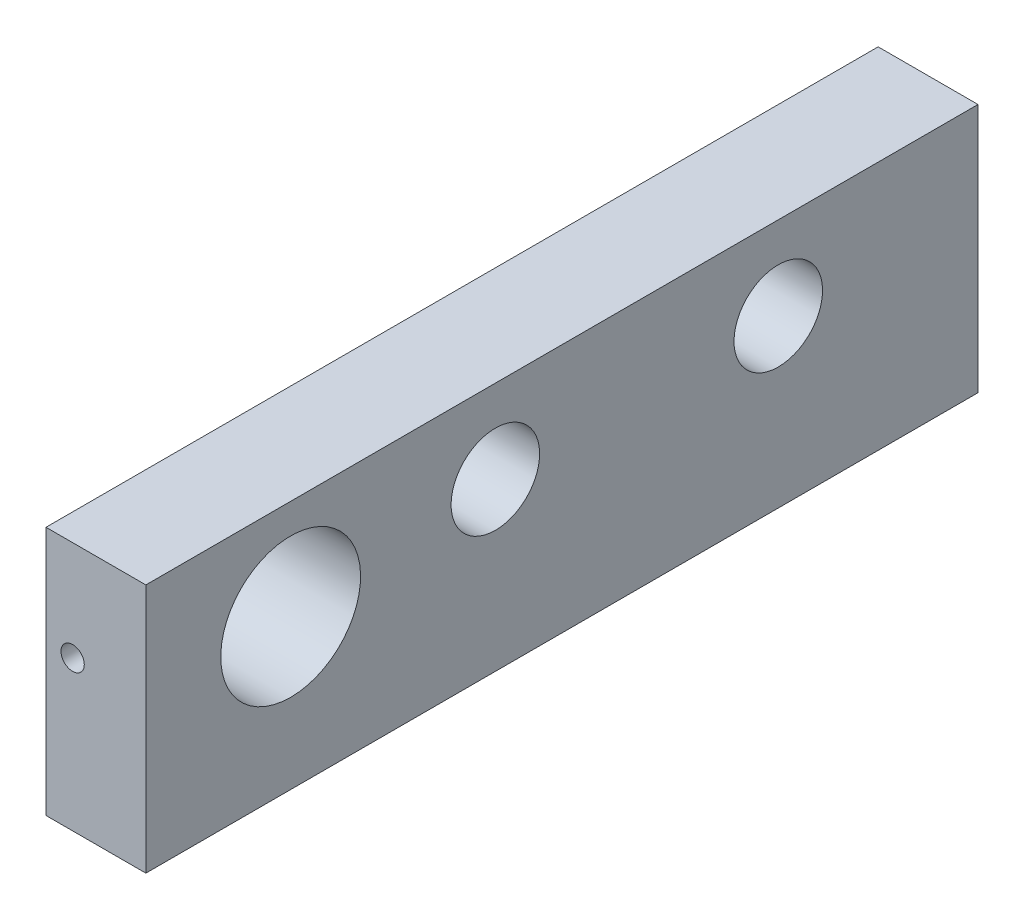
ISO-10303-21;
HEADER;
FILE_DESCRIPTION(('STEP AP214'),'2;1');
FILE_NAME('part.step','',(''),(''),'','','');
FILE_SCHEMA(('AUTOMOTIVE_DESIGN { 1 0 10303 214 1 1 1 1 }'));
ENDSEC;
DATA;
#1=APPLICATION_CONTEXT('core data for automotive mechanical design processes');
#2=APPLICATION_PROTOCOL_DEFINITION('international standard','automotive_design',2000,#1);
#3=PRODUCT_CONTEXT('',#1,'mechanical');
#4=PRODUCT('Part','Part','',(#3));
#5=PRODUCT_RELATED_PRODUCT_CATEGORY('part','',(#4));
#6=PRODUCT_DEFINITION_FORMATION('','',#4);
#7=PRODUCT_DEFINITION_CONTEXT('part definition',#1,'design');
#8=PRODUCT_DEFINITION('design','',#6,#7);
#9=PRODUCT_DEFINITION_SHAPE('','',#8);
#10=(LENGTH_UNIT() NAMED_UNIT(*) SI_UNIT(.MILLI.,.METRE.));
#11=(NAMED_UNIT(*) PLANE_ANGLE_UNIT() SI_UNIT($,.RADIAN.));
#12=(NAMED_UNIT(*) SI_UNIT($,.STERADIAN.) SOLID_ANGLE_UNIT());
#13=UNCERTAINTY_MEASURE_WITH_UNIT(LENGTH_MEASURE(1.E-05),#10,'distance_accuracy_value','');
#14=(GEOMETRIC_REPRESENTATION_CONTEXT(3) GLOBAL_UNCERTAINTY_ASSIGNED_CONTEXT((#13)) GLOBAL_UNIT_ASSIGNED_CONTEXT((#10,
#11,#12)) REPRESENTATION_CONTEXT('',''));
#15=CARTESIAN_POINT('',(0.,0.,0.));
#16=DIRECTION('',(0.,0.,1.));
#17=DIRECTION('',(1.,0.,0.));
#18=AXIS2_PLACEMENT_3D('',#15,#16,#17);
#19=CARTESIAN_POINT('',(0.,0.,-63.5));
#20=DIRECTION('',(-1.,0.,0.));
#21=DIRECTION('',(0.,-1.,0.));
#22=AXIS2_PLACEMENT_3D('',#19,#20,#21);
#23=PLANE('',#22);
#24=CARTESIAN_POINT('',(0.,11.43,-11.049));
#25=DIRECTION('',(-1.,0.,0.));
#26=DIRECTION('',(0.,-1.,0.));
#27=AXIS2_PLACEMENT_3D('',#24,#25,#26);
#28=CIRCLE('',#27,5.334);
#29=CARTESIAN_POINT('',(0.,6.096,-11.049));
#30=VERTEX_POINT('',#29);
#31=EDGE_CURVE('E167',#30,#30,#28,.T.);
#32=ORIENTED_EDGE('',*,*,#31,.F.);
#33=EDGE_LOOP('',(#32));
#34=FACE_BOUND('',#33,.T.);
#35=CARTESIAN_POINT('',(0.,12.7,-26.67));
#36=DIRECTION('',(-1.,0.,0.));
#37=DIRECTION('',(0.,-1.,0.));
#38=AXIS2_PLACEMENT_3D('',#35,#36,#37);
#39=CIRCLE('',#38,3.3782);
#40=CARTESIAN_POINT('',(0.,9.3218,-26.67));
#41=VERTEX_POINT('',#40);
#42=EDGE_CURVE('E174',#41,#41,#39,.T.);
#43=ORIENTED_EDGE('',*,*,#42,.F.);
#44=EDGE_LOOP('',(#43));
#45=FACE_BOUND('',#44,.T.);
#46=CARTESIAN_POINT('',(0.,12.7,-48.26));
#47=DIRECTION('',(-1.,0.,0.));
#48=DIRECTION('',(0.,-1.,0.));
#49=AXIS2_PLACEMENT_3D('',#46,#47,#48);
#50=CIRCLE('',#49,3.3782);
#51=CARTESIAN_POINT('',(0.,9.3218,-48.26));
#52=VERTEX_POINT('',#51);
#53=EDGE_CURVE('E182',#52,#52,#50,.T.);
#54=ORIENTED_EDGE('',*,*,#53,.F.);
#55=EDGE_LOOP('',(#54));
#56=FACE_BOUND('',#55,.T.);
#57=DIRECTION('',(0.,-1.,0.));
#58=VECTOR('',#57,1.);
#59=CARTESIAN_POINT('',(0.,0.,0.));
#60=LINE('',#59,#58);
#61=CARTESIAN_POINT('',(0.,19.05,0.));
#62=VERTEX_POINT('',#61);
#63=CARTESIAN_POINT('',(0.,0.,0.));
#64=VERTEX_POINT('',#63);
#65=EDGE_CURVE('E115',#62,#64,#60,.T.);
#66=ORIENTED_EDGE('',*,*,#65,.F.);
#67=DIRECTION('',(0.,0.,1.));
#68=VECTOR('',#67,1.);
#69=CARTESIAN_POINT('',(0.,19.05,-63.5));
#70=LINE('',#69,#68);
#71=CARTESIAN_POINT('',(0.,19.05,-63.5));
#72=VERTEX_POINT('',#71);
#73=EDGE_CURVE('E11',#72,#62,#70,.T.);
#74=ORIENTED_EDGE('',*,*,#73,.F.);
#75=DIRECTION('',(0.,-1.,0.));
#76=VECTOR('',#75,1.);
#77=CARTESIAN_POINT('',(0.,0.,-63.5));
#78=LINE('',#77,#76);
#79=CARTESIAN_POINT('',(0.,0.,-63.5));
#80=VERTEX_POINT('',#79);
#81=EDGE_CURVE('E108',#72,#80,#78,.T.);
#82=ORIENTED_EDGE('',*,*,#81,.T.);
#83=DIRECTION('',(0.,0.,1.));
#84=VECTOR('',#83,1.);
#85=CARTESIAN_POINT('',(0.,0.,-63.5));
#86=LINE('',#85,#84);
#87=EDGE_CURVE('E91',#80,#64,#86,.T.);
#88=ORIENTED_EDGE('',*,*,#87,.T.);
#89=EDGE_LOOP('',(#66,#74,#82,#88));
#90=FACE_BOUND('',#89,.T.);
#91=ADVANCED_FACE('F43',(#34,#45,#56,#90),#23,.T.);
#92=CARTESIAN_POINT('',(0.,19.05,-63.5));
#93=DIRECTION('',(0.,1.,0.));
#94=DIRECTION('',(0.,0.,1.));
#95=AXIS2_PLACEMENT_3D('',#92,#93,#94);
#96=PLANE('',#95);
#97=DIRECTION('',(-1.,0.,0.));
#98=VECTOR('',#97,1.);
#99=CARTESIAN_POINT('',(0.,19.05,0.));
#100=LINE('',#99,#98);
#101=CARTESIAN_POINT('',(7.61999999999999,19.05,0.));
#102=VERTEX_POINT('',#101);
#103=EDGE_CURVE('E110',#102,#62,#100,.T.);
#104=ORIENTED_EDGE('',*,*,#103,.F.);
#105=DIRECTION('',(0.,0.,1.));
#106=VECTOR('',#105,1.);
#107=CARTESIAN_POINT('',(7.61999999999999,19.05,-63.5));
#108=LINE('',#107,#106);
#109=CARTESIAN_POINT('',(7.61999999999999,19.05,-63.5));
#110=VERTEX_POINT('',#109);
#111=EDGE_CURVE('E57',#110,#102,#108,.T.);
#112=ORIENTED_EDGE('',*,*,#111,.F.);
#113=DIRECTION('',(-1.,0.,0.));
#114=VECTOR('',#113,1.);
#115=CARTESIAN_POINT('',(0.,19.05,-63.5));
#116=LINE('',#115,#114);
#117=EDGE_CURVE('E105',#110,#72,#116,.T.);
#118=ORIENTED_EDGE('',*,*,#117,.T.);
#119=ORIENTED_EDGE('',*,*,#73,.T.);
#120=EDGE_LOOP('',(#104,#112,#118,#119));
#121=FACE_BOUND('',#120,.T.);
#122=ADVANCED_FACE('F126',(#121),#96,.T.);
#123=CARTESIAN_POINT('',(7.62,0.,-63.5));
#124=DIRECTION('',(1.,0.,0.));
#125=DIRECTION('',(0.,1.,0.));
#126=AXIS2_PLACEMENT_3D('',#123,#124,#125);
#127=PLANE('',#126);
#128=CARTESIAN_POINT('',(7.62,11.43,-11.049));
#129=DIRECTION('',(-1.,0.,0.));
#130=DIRECTION('',(0.,-1.,0.));
#131=AXIS2_PLACEMENT_3D('',#128,#129,#130);
#132=CIRCLE('',#131,5.334);
#133=CARTESIAN_POINT('',(7.62,6.096,-11.049));
#134=VERTEX_POINT('',#133);
#135=EDGE_CURVE('E171',#134,#134,#132,.T.);
#136=ORIENTED_EDGE('',*,*,#135,.T.);
#137=EDGE_LOOP('',(#136));
#138=FACE_BOUND('',#137,.T.);
#139=CARTESIAN_POINT('',(7.62,12.7,-26.67));
#140=DIRECTION('',(-1.,0.,0.));
#141=DIRECTION('',(0.,-1.,0.));
#142=AXIS2_PLACEMENT_3D('',#139,#140,#141);
#143=CIRCLE('',#142,3.3782);
#144=CARTESIAN_POINT('',(7.62,9.3218,-26.67));
#145=VERTEX_POINT('',#144);
#146=EDGE_CURVE('E176',#145,#145,#143,.T.);
#147=ORIENTED_EDGE('',*,*,#146,.T.);
#148=EDGE_LOOP('',(#147));
#149=FACE_BOUND('',#148,.T.);
#150=CARTESIAN_POINT('',(7.62,12.7,-48.26));
#151=DIRECTION('',(-1.,0.,0.));
#152=DIRECTION('',(0.,-1.,0.));
#153=AXIS2_PLACEMENT_3D('',#150,#151,#152);
#154=CIRCLE('',#153,3.3782);
#155=CARTESIAN_POINT('',(7.62,9.3218,-48.26));
#156=VERTEX_POINT('',#155);
#157=EDGE_CURVE('E184',#156,#156,#154,.T.);
#158=ORIENTED_EDGE('',*,*,#157,.T.);
#159=EDGE_LOOP('',(#158));
#160=FACE_BOUND('',#159,.T.);
#161=DIRECTION('',(0.,1.,0.));
#162=VECTOR('',#161,1.);
#163=CARTESIAN_POINT('',(7.62,0.,0.));
#164=LINE('',#163,#162);
#165=CARTESIAN_POINT('',(7.62,0.,0.));
#166=VERTEX_POINT('',#165);
#167=EDGE_CURVE('E99',#166,#102,#164,.T.);
#168=ORIENTED_EDGE('',*,*,#167,.F.);
#169=DIRECTION('',(0.,0.,1.));
#170=VECTOR('',#169,1.);
#171=CARTESIAN_POINT('',(7.62,0.,-63.5));
#172=LINE('',#171,#170);
#173=CARTESIAN_POINT('',(7.62,0.,-63.5));
#174=VERTEX_POINT('',#173);
#175=EDGE_CURVE('E94',#174,#166,#172,.T.);
#176=ORIENTED_EDGE('',*,*,#175,.F.);
#177=DIRECTION('',(0.,1.,0.));
#178=VECTOR('',#177,1.);
#179=CARTESIAN_POINT('',(7.62,0.,-63.5));
#180=LINE('',#179,#178);
#181=EDGE_CURVE('E97',#174,#110,#180,.T.);
#182=ORIENTED_EDGE('',*,*,#181,.T.);
#183=ORIENTED_EDGE('',*,*,#111,.T.);
#184=EDGE_LOOP('',(#168,#176,#182,#183));
#185=FACE_BOUND('',#184,.T.);
#186=ADVANCED_FACE('F96',(#138,#149,#160,#185),#127,.T.);
#187=CARTESIAN_POINT('',(0.,0.,-63.5));
#188=DIRECTION('',(0.,-1.,0.));
#189=DIRECTION('',(0.,0.,-1.));
#190=AXIS2_PLACEMENT_3D('',#187,#188,#189);
#191=PLANE('',#190);
#192=DIRECTION('',(1.,0.,0.));
#193=VECTOR('',#192,1.);
#194=CARTESIAN_POINT('',(0.,0.,0.));
#195=LINE('',#194,#193);
#196=EDGE_CURVE('E118',#64,#166,#195,.T.);
#197=ORIENTED_EDGE('',*,*,#196,.F.);
#198=ORIENTED_EDGE('',*,*,#87,.F.);
#199=DIRECTION('',(1.,0.,0.));
#200=VECTOR('',#199,1.);
#201=CARTESIAN_POINT('',(0.,0.,-63.5));
#202=LINE('',#201,#200);
#203=EDGE_CURVE('E104',#80,#174,#202,.T.);
#204=ORIENTED_EDGE('',*,*,#203,.T.);
#205=ORIENTED_EDGE('',*,*,#175,.T.);
#206=EDGE_LOOP('',(#197,#198,#204,#205));
#207=FACE_BOUND('',#206,.T.);
#208=ADVANCED_FACE('F107',(#207),#191,.T.);
#209=CARTESIAN_POINT('',(0.,0.,-63.5));
#210=DIRECTION('',(0.,0.,-1.));
#211=DIRECTION('',(-1.,0.,0.));
#212=AXIS2_PLACEMENT_3D('',#209,#210,#211);
#213=PLANE('',#212);
#214=ORIENTED_EDGE('',*,*,#81,.F.);
#215=ORIENTED_EDGE('',*,*,#117,.F.);
#216=ORIENTED_EDGE('',*,*,#181,.F.);
#217=ORIENTED_EDGE('',*,*,#203,.F.);
#218=EDGE_LOOP('',(#214,#215,#216,#217));
#219=FACE_BOUND('',#218,.T.);
#220=ADVANCED_FACE('F103',(#219),#213,.T.);
#221=CARTESIAN_POINT('',(0.,0.,0.));
#222=DIRECTION('',(0.,0.,-1.));
#223=DIRECTION('',(-1.,0.,0.));
#224=AXIS2_PLACEMENT_3D('',#221,#222,#223);
#225=PLANE('',#224);
#226=CARTESIAN_POINT('',(2.032,11.43,0.));
#227=DIRECTION('',(0.,0.,1.));
#228=DIRECTION('',(1.,0.,0.));
#229=AXIS2_PLACEMENT_3D('',#226,#227,#228);
#230=CIRCLE('',#229,0.889);
#231=CARTESIAN_POINT('',(2.921,11.43,0.));
#232=VERTEX_POINT('',#231);
#233=EDGE_CURVE('E119',#232,#232,#230,.T.);
#234=ORIENTED_EDGE('',*,*,#233,.F.);
#235=EDGE_LOOP('',(#234));
#236=FACE_BOUND('',#235,.T.);
#237=ORIENTED_EDGE('',*,*,#65,.T.);
#238=ORIENTED_EDGE('',*,*,#196,.T.);
#239=ORIENTED_EDGE('',*,*,#167,.T.);
#240=ORIENTED_EDGE('',*,*,#103,.T.);
#241=EDGE_LOOP('',(#237,#238,#239,#240));
#242=FACE_BOUND('',#241,.T.);
#243=ADVANCED_FACE('F125',(#236,#242),#225,.F.);
#244=CARTESIAN_POINT('',(2.032,11.43,-6.35));
#245=DIRECTION('',(0.,0.,1.));
#246=DIRECTION('',(1.,0.,0.));
#247=AXIS2_PLACEMENT_3D('',#244,#245,#246);
#248=CYLINDRICAL_SURFACE('',#247,0.889);
#249=CARTESIAN_POINT('',(2.921,11.43,-5.715));
#250=CARTESIAN_POINT('',(2.92099801257015,11.3804325941969,-5.71500084928367));
#251=CARTESIAN_POINT('',(2.91684044902105,11.3308381372181,-5.71569812134125));
#252=CARTESIAN_POINT('',(2.90032695974305,11.2330401931731,-5.71841253338843));
#253=CARTESIAN_POINT('',(2.88796349516223,11.1848380277537,-5.72043088704665));
#254=CARTESIAN_POINT('',(2.85542186648041,11.0912537518912,-5.72556107735119));
#255=CARTESIAN_POINT('',(2.83525009481821,11.0458693697856,-5.72867201933391));
#256=CARTESIAN_POINT('',(2.78768118894616,10.9591351609926,-5.73564532849616));
#257=CARTESIAN_POINT('',(2.76028488112704,10.9177848735992,-5.73950760971924));
#258=CARTESIAN_POINT('',(2.69876597219344,10.8398915383579,-5.74759672311824));
#259=CARTESIAN_POINT('',(2.66458782283539,10.803392651503,-5.75182639182637));
#260=CARTESIAN_POINT('',(2.59059498241107,10.7366196498765,-5.76015185882634));
#261=CARTESIAN_POINT('',(2.55077993575803,10.7063459280966,-5.76424764865276));
#262=CARTESIAN_POINT('',(2.46634016442032,10.6527056501348,-5.77186909615822));
#263=CARTESIAN_POINT('',(2.42168734063223,10.6293827610026,-5.77539108895014));
#264=CARTESIAN_POINT('',(2.32902927893469,10.5905854452598,-5.78142682749014));
#265=CARTESIAN_POINT('',(2.28102426772423,10.5751104884993,-5.78394064134113));
#266=CARTESIAN_POINT('',(2.18349261426101,10.5525874472597,-5.78764717098717));
#267=CARTESIAN_POINT('',(2.1339840401001,10.5454631252395,-5.78885183126485));
#268=CARTESIAN_POINT('',(2.03446065354023,10.5396072124869,-5.78983979314128));
#269=CARTESIAN_POINT('',(1.98444587721811,10.5408750277977,-5.78962319533015));
#270=CARTESIAN_POINT('',(1.88587405253045,10.5517053030103,-5.7878040189612));
#271=CARTESIAN_POINT('',(1.83730729185931,10.56118212,-5.78621575127794));
#272=CARTESIAN_POINT('',(1.74246289937996,10.5880269832725,-5.78185459502966));
#273=CARTESIAN_POINT('',(1.69618534614323,10.6053953002039,-5.77908166583545));
#274=CARTESIAN_POINT('',(1.60697663038441,10.647616971289,-5.77264816748794));
#275=CARTESIAN_POINT('',(1.56406261519751,10.6725058890244,-5.76898339736635));
#276=CARTESIAN_POINT('',(1.48298759516855,10.7290370065566,-5.76118206211623));
#277=CARTESIAN_POINT('',(1.44482697433902,10.7606797514153,-5.75704545892136));
#278=CARTESIAN_POINT('',(1.3738462438869,10.8302869253562,-5.74870366885949));
#279=CARTESIAN_POINT('',(1.34109817480714,10.8683248344467,-5.74449826733225));
#280=CARTESIAN_POINT('',(1.2824386675962,10.9493940654621,-5.73654010943326));
#281=CARTESIAN_POINT('',(1.25652727351484,10.9924254195581,-5.73278735597807));
#282=CARTESIAN_POINT('',(1.21227008803033,11.0823277762111,-5.72615199687281));
#283=CARTESIAN_POINT('',(1.1939306608858,11.1292019691892,-5.72327012374312));
#284=CARTESIAN_POINT('',(1.16540485705853,11.2254239083037,-5.71870711928699));
#285=CARTESIAN_POINT('',(1.15521779833214,11.2747714471478,-5.71702588751372));
#286=CARTESIAN_POINT('',(1.14338356493122,11.3739183590971,-5.71506710227941));
#287=CARTESIAN_POINT('',(1.14163749306592,11.4237056178691,-5.71477329428654));
#288=CARTESIAN_POINT('',(1.14647113407864,11.5228613032396,-5.71557794095832));
#289=CARTESIAN_POINT('',(1.15305052660635,11.57222974588,-5.71667634205304));
#290=CARTESIAN_POINT('',(1.17426607642369,11.6688409360244,-5.72013192340776));
#291=CARTESIAN_POINT('',(1.18885327170352,11.7160947327978,-5.72248145132654));
#292=CARTESIAN_POINT('',(1.22561815467175,11.8074860722564,-5.72817688439675));
#293=CARTESIAN_POINT('',(1.2477962686111,11.8516234397775,-5.73152284549926));
#294=CARTESIAN_POINT('',(1.29933993994217,11.9359585931752,-5.73888026002864));
#295=CARTESIAN_POINT('',(1.32876727353307,11.9761181232332,-5.74289733246575));
#296=CARTESIAN_POINT('',(1.39388906935092,12.0509642190048,-5.7511344099544));
#297=CARTESIAN_POINT('',(1.42958398679718,12.0856503868361,-5.75535442972998));
#298=CARTESIAN_POINT('',(1.50667124809419,12.1489317324464,-5.76357433686134));
#299=CARTESIAN_POINT('',(1.54811878125692,12.177460091452,-5.76757149101645));
#300=CARTESIAN_POINT('',(1.63527591582566,12.2271493415409,-5.77484204010985));
#301=CARTESIAN_POINT('',(1.68098538207089,12.2483104661641,-5.77811545798924));
#302=CARTESIAN_POINT('',(1.77518202898799,12.2825646306718,-5.78354739865097));
#303=CARTESIAN_POINT('',(1.82365683859284,12.295690929414,-5.78571051126986));
#304=CARTESIAN_POINT('',(1.92216231795125,12.3136074873636,-5.78868843893382));
#305=CARTESIAN_POINT('',(1.97219285205671,12.3183984712881,-5.78950337119664));
#306=CARTESIAN_POINT('',(2.07172235701623,12.3194881911664,-5.78968761715326));
#307=CARTESIAN_POINT('',(2.12122017462137,12.3158921044061,-5.78907483506591));
#308=CARTESIAN_POINT('',(2.21889598060685,12.3005371907331,-5.78651193715055));
#309=CARTESIAN_POINT('',(2.26707397326452,12.2887783902776,-5.78456182565713));
#310=CARTESIAN_POINT('',(2.36070186030125,12.2574721284999,-5.77955080106221));
#311=CARTESIAN_POINT('',(2.40615485597592,12.2379337224175,-5.77649117976686));
#312=CARTESIAN_POINT('',(2.49315476396568,12.1916336825925,-5.76960462411263));
#313=CARTESIAN_POINT('',(2.53470148240833,12.164871690591,-5.76577765169885));
#314=CARTESIAN_POINT('',(2.61324085335311,12.1045087952827,-5.75773083741377));
#315=CARTESIAN_POINT('',(2.65017362353861,12.0708305164139,-5.75350687293067));
#316=CARTESIAN_POINT('',(2.71789963055128,11.9977541715588,-5.74517489188485));
#317=CARTESIAN_POINT('',(2.74869144852773,11.9583547873517,-5.7410669023056));
#318=CARTESIAN_POINT('',(2.8034558041719,11.8746312767241,-5.73339686059227));
#319=CARTESIAN_POINT('',(2.82737977957968,11.8302750192467,-5.72983877460396));
#320=CARTESIAN_POINT('',(2.86740022872728,11.7381320474712,-5.72370804800809));
#321=CARTESIAN_POINT('',(2.88350449803194,11.6903488043616,-5.72113442652088));
#322=CARTESIAN_POINT('',(2.90393307547944,11.6069832970521,-5.71782420779801));
#323=CARTESIAN_POINT('',(2.91032292139543,11.5719053200541,-5.71677079101594));
#324=CARTESIAN_POINT('',(2.91885706117759,11.5012228787497,-5.71535838795336));
#325=CARTESIAN_POINT('',(2.92100142813844,11.4656184235184,-5.714999389717));
#326=CARTESIAN_POINT('',(2.921,11.43,-5.715));
#327=B_SPLINE_CURVE_WITH_KNOTS('',3,(#249,#250,#251,#252,#253,#254,#255,#256,#257,#258,#259,
#260,#261,#262,#263,#264,#265,#266,#267,#268,#269,#270,#271,#272,#273,#274,#275,#276,#277,#278,
#279,#280,#281,#282,#283,#284,#285,#286,#287,#288,#289,#290,#291,#292,#293,#294,#295,#296,#297,
#298,#299,#300,#301,#302,#303,#304,#305,#306,#307,#308,#309,#310,#311,#312,#313,#314,#315,#316,
#317,#318,#319,#320,#321,#322,#323,#324,#325,#326),.UNSPECIFIED.,.T.,.F.,(4,2,2,2,2,2,2,2,2,2,2,
2,2,2,2,2,2,2,2,2,2,2,2,2,2,2,2,2,2,2,2,2,2,2,2,2,2,2,4),(0.,0.148572021604134,
0.297280727249291,0.445867945914185,0.594438175547154,0.744279658217651,0.894130597404008,
1.04490400404957,1.1956672241717,1.34504305017977,1.49440830416507,1.64223377538001,
1.79006431683025,1.93860516338537,2.08715800234012,2.23755172980468,2.38794642625707,
2.53846727378495,2.6889755271172,2.8377160336954,2.98645081715552,3.13428616171481,
3.28212980899749,3.4312797919297,3.58044061222103,3.73114659105909,3.88184779210885,
4.03192089544734,4.18198094996921,4.33016932626272,4.478357222245,4.62637313361244,
4.77439638728432,4.9241759221917,5.07399002327362,5.2248387355952,5.37553675457453,
5.48230030647125,5.5890620201969),.UNSPECIFIED.);
#328=CARTESIAN_POINT('',(2.921,11.43,-5.715));
#329=VERTEX_POINT('',#328);
#330=EDGE_CURVE('E46',#329,#329,#327,.T.);
#331=ORIENTED_EDGE('',*,*,#330,.T.);
#332=EDGE_LOOP('',(#331));
#333=FACE_BOUND('',#332,.T.);
#334=ORIENTED_EDGE('',*,*,#233,.T.);
#335=EDGE_LOOP('',(#334));
#336=FACE_BOUND('',#335,.T.);
#337=ADVANCED_FACE('F145',(#333,#336),#248,.F.);
#338=CARTESIAN_POINT('',(7.62,12.7,-48.26));
#339=DIRECTION('',(-1.,0.,0.));
#340=DIRECTION('',(0.,-1.,0.));
#341=AXIS2_PLACEMENT_3D('',#338,#339,#340);
#342=CYLINDRICAL_SURFACE('',#341,3.3782);
#343=ORIENTED_EDGE('',*,*,#157,.F.);
#344=EDGE_LOOP('',(#343));
#345=FACE_BOUND('',#344,.T.);
#346=ORIENTED_EDGE('',*,*,#53,.T.);
#347=EDGE_LOOP('',(#346));
#348=FACE_BOUND('',#347,.T.);
#349=ADVANCED_FACE('F150',(#345,#348),#342,.F.);
#350=CARTESIAN_POINT('',(7.62,12.7,-26.67));
#351=DIRECTION('',(-1.,0.,0.));
#352=DIRECTION('',(0.,-1.,0.));
#353=AXIS2_PLACEMENT_3D('',#350,#351,#352);
#354=CYLINDRICAL_SURFACE('',#353,3.3782);
#355=ORIENTED_EDGE('',*,*,#146,.F.);
#356=EDGE_LOOP('',(#355));
#357=FACE_BOUND('',#356,.T.);
#358=ORIENTED_EDGE('',*,*,#42,.T.);
#359=EDGE_LOOP('',(#358));
#360=FACE_BOUND('',#359,.T.);
#361=ADVANCED_FACE('F154',(#357,#360),#354,.F.);
#362=CARTESIAN_POINT('',(7.62,11.43,-11.049));
#363=DIRECTION('',(-1.,0.,0.));
#364=DIRECTION('',(0.,-1.,0.));
#365=AXIS2_PLACEMENT_3D('',#362,#363,#364);
#366=CYLINDRICAL_SURFACE('',#365,5.334);
#367=ORIENTED_EDGE('',*,*,#31,.T.);
#368=EDGE_LOOP('',(#367));
#369=FACE_BOUND('',#368,.T.);
#370=ORIENTED_EDGE('',*,*,#135,.F.);
#371=EDGE_LOOP('',(#370));
#372=FACE_BOUND('',#371,.T.);
#373=ORIENTED_EDGE('',*,*,#330,.F.);
#374=EDGE_LOOP('',(#373));
#375=FACE_BOUND('',#374,.T.);
#376=ADVANCED_FACE('F157',(#369,#372,#375),#366,.F.);
#377=CLOSED_SHELL('',(#91,#122,#186,#208,#220,#243,#337,#349,#361,#376));
#378=MANIFOLD_SOLID_BREP('B2',#377);
#379=ADVANCED_BREP_SHAPE_REPRESENTATION('',(#18,#378),#14);
#380=SHAPE_DEFINITION_REPRESENTATION(#9,#379);
ENDSEC;
END-ISO-10303-21;
